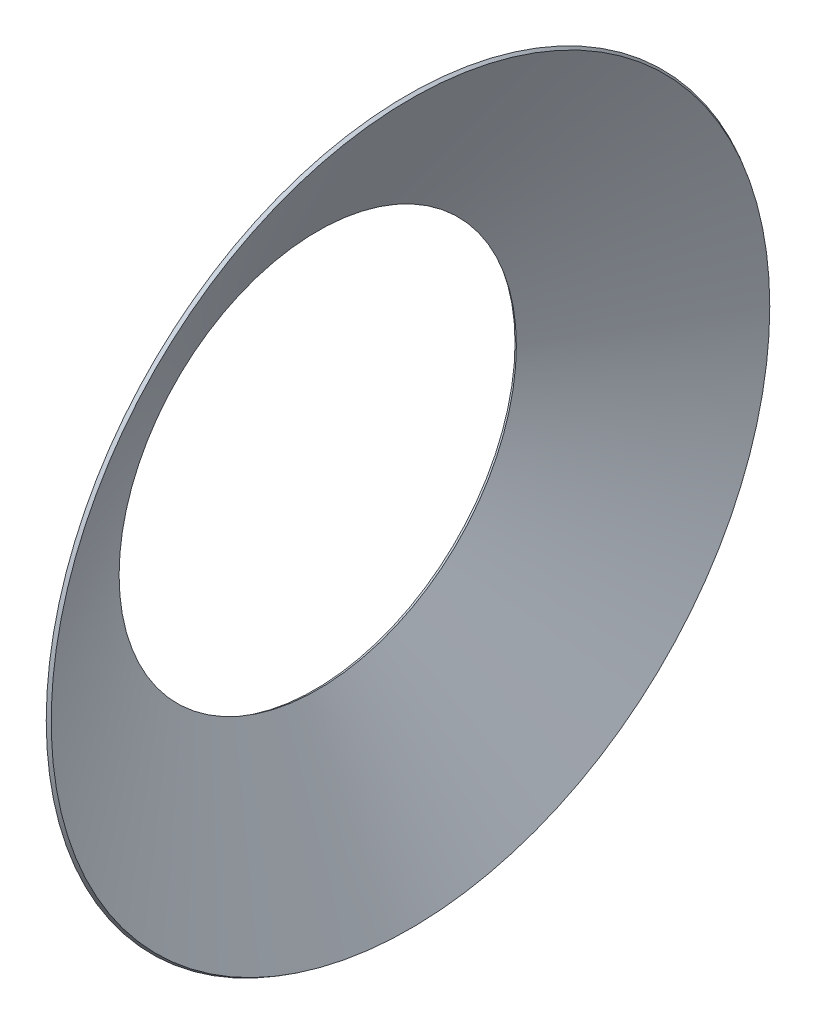
ISO-10303-21;
HEADER;
FILE_DESCRIPTION(('STEP AP214'),'2;1');
FILE_NAME('part.step','',(''),(''),'','','');
FILE_SCHEMA(('AUTOMOTIVE_DESIGN { 1 0 10303 214 1 1 1 1 }'));
ENDSEC;
DATA;
#1=APPLICATION_CONTEXT('core data for automotive mechanical design processes');
#2=APPLICATION_PROTOCOL_DEFINITION('international standard','automotive_design',2000,#1);
#3=PRODUCT_CONTEXT('',#1,'mechanical');
#4=PRODUCT('Part','Part','',(#3));
#5=PRODUCT_RELATED_PRODUCT_CATEGORY('part','',(#4));
#6=PRODUCT_DEFINITION_FORMATION('','',#4);
#7=PRODUCT_DEFINITION_CONTEXT('part definition',#1,'design');
#8=PRODUCT_DEFINITION('design','',#6,#7);
#9=PRODUCT_DEFINITION_SHAPE('','',#8);
#10=(LENGTH_UNIT() NAMED_UNIT(*) SI_UNIT(.MILLI.,.METRE.));
#11=(NAMED_UNIT(*) PLANE_ANGLE_UNIT() SI_UNIT($,.RADIAN.));
#12=(NAMED_UNIT(*) SI_UNIT($,.STERADIAN.) SOLID_ANGLE_UNIT());
#13=UNCERTAINTY_MEASURE_WITH_UNIT(LENGTH_MEASURE(1.E-05),#10,'distance_accuracy_value','');
#14=(GEOMETRIC_REPRESENTATION_CONTEXT(3) GLOBAL_UNCERTAINTY_ASSIGNED_CONTEXT((#13)) GLOBAL_UNIT_ASSIGNED_CONTEXT((#10,
#11,#12)) REPRESENTATION_CONTEXT('',''));
#15=CARTESIAN_POINT('',(0.,0.,0.));
#16=DIRECTION('',(0.,0.,1.));
#17=DIRECTION('',(1.,0.,0.));
#18=AXIS2_PLACEMENT_3D('',#15,#16,#17);
#19=CARTESIAN_POINT('',(-2751.65002171935,0.,0.));
#20=DIRECTION('',(1.,0.,0.));
#21=DIRECTION('',(0.,0.,-1.));
#22=AXIS2_PLACEMENT_3D('',#19,#20,#21);
#23=CONICAL_SURFACE('',#22,4961.19780083202,1.04721746485622);
#24=CARTESIAN_POINT('',(-4025.91816016538,0.,0.));
#25=DIRECTION('',(1.,0.,0.));
#26=DIRECTION('',(0.,0.,-1.));
#27=AXIS2_PLACEMENT_3D('',#24,#25,#26);
#28=CIRCLE('',#27,2753.99913770829);
#29=CARTESIAN_POINT('',(-4025.91816016538,0.,-2753.99913770829));
#30=VERTEX_POINT('',#29);
#31=EDGE_CURVE('E10',#30,#30,#28,.T.);
#32=ORIENTED_EDGE('',*,*,#31,.T.);
#33=EDGE_LOOP('',(#32));
#34=FACE_BOUND('',#33,.T.);
#35=CARTESIAN_POINT('',(-2751.65002171935,0.,0.));
#36=DIRECTION('',(1.,0.,0.));
#37=DIRECTION('',(0.,0.,-1.));
#38=AXIS2_PLACEMENT_3D('',#35,#36,#37);
#39=CIRCLE('',#38,4961.19780083202);
#40=CARTESIAN_POINT('',(-2751.65002171935,0.,-4961.19780083202));
#41=VERTEX_POINT('',#40);
#42=EDGE_CURVE('E44',#41,#41,#39,.T.);
#43=ORIENTED_EDGE('',*,*,#42,.F.);
#44=EDGE_LOOP('',(#43));
#45=FACE_BOUND('',#44,.T.);
#46=ADVANCED_FACE('F30',(#34,#45),#23,.T.);
#47=CARTESIAN_POINT('',(-4025.91816016538,0.,0.));
#48=DIRECTION('',(-1.,0.,0.));
#49=DIRECTION('',(0.,0.,1.));
#50=AXIS2_PLACEMENT_3D('',#47,#48,#49);
#51=CONICAL_SURFACE('',#50,2753.99913770829,0.523578861938672);
#52=CARTESIAN_POINT('',(-3982.61639214326,0.,0.));
#53=DIRECTION('',(1.,0.,0.));
#54=DIRECTION('',(0.,0.,-1.));
#55=AXIS2_PLACEMENT_3D('',#52,#53,#54);
#56=CIRCLE('',#55,2729.);
#57=CARTESIAN_POINT('',(-3982.61639214326,0.,-2729.));
#58=VERTEX_POINT('',#57);
#59=EDGE_CURVE('E36',#58,#58,#56,.T.);
#60=ORIENTED_EDGE('',*,*,#59,.T.);
#61=EDGE_LOOP('',(#60));
#62=FACE_BOUND('',#61,.T.);
#63=ORIENTED_EDGE('',*,*,#31,.F.);
#64=EDGE_LOOP('',(#63));
#65=FACE_BOUND('',#64,.T.);
#66=ADVANCED_FACE('F54',(#62,#65),#51,.F.);
#67=CARTESIAN_POINT('',(-3982.61639214326,0.,0.));
#68=DIRECTION('',(1.,0.,0.));
#69=DIRECTION('',(0.,0.,-1.));
#70=AXIS2_PLACEMENT_3D('',#67,#68,#69);
#71=CONICAL_SURFACE('',#70,2729.,1.04721746485622);
#72=CARTESIAN_POINT('',(-2708.34825369722,0.,0.));
#73=DIRECTION('',(1.,0.,0.));
#74=DIRECTION('',(0.,0.,-1.));
#75=AXIS2_PLACEMENT_3D('',#72,#73,#74);
#76=CIRCLE('',#75,4936.19866312373);
#77=CARTESIAN_POINT('',(-2708.34825369722,0.,-4936.19866312373));
#78=VERTEX_POINT('',#77);
#79=EDGE_CURVE('E40',#78,#78,#76,.T.);
#80=ORIENTED_EDGE('',*,*,#79,.T.);
#81=EDGE_LOOP('',(#80));
#82=FACE_BOUND('',#81,.T.);
#83=ORIENTED_EDGE('',*,*,#59,.F.);
#84=EDGE_LOOP('',(#83));
#85=FACE_BOUND('',#84,.T.);
#86=ADVANCED_FACE('F58',(#82,#85),#71,.F.);
#87=CARTESIAN_POINT('',(-2708.34825369722,0.,0.));
#88=DIRECTION('',(-1.,0.,0.));
#89=DIRECTION('',(0.,0.,1.));
#90=AXIS2_PLACEMENT_3D('',#87,#88,#89);
#91=CONICAL_SURFACE('',#90,4936.19866312373,0.523578861938673);
#92=ORIENTED_EDGE('',*,*,#42,.T.);
#93=EDGE_LOOP('',(#92));
#94=FACE_BOUND('',#93,.T.);
#95=ORIENTED_EDGE('',*,*,#79,.F.);
#96=EDGE_LOOP('',(#95));
#97=FACE_BOUND('',#96,.T.);
#98=ADVANCED_FACE('F50',(#94,#97),#91,.T.);
#99=CLOSED_SHELL('',(#46,#66,#86,#98));
#100=MANIFOLD_SOLID_BREP('B2',#99);
#101=ADVANCED_BREP_SHAPE_REPRESENTATION('',(#18,#100),#14);
#102=SHAPE_DEFINITION_REPRESENTATION(#9,#101);
ENDSEC;
END-ISO-10303-21;
